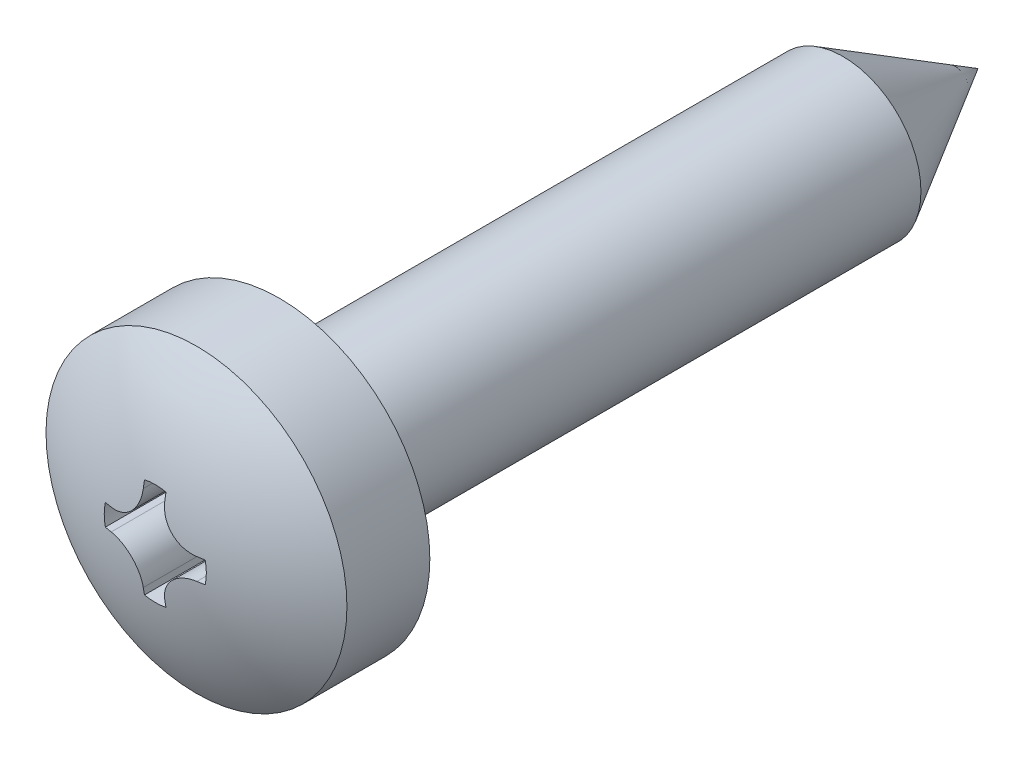
ISO-10303-21;
HEADER;
FILE_DESCRIPTION(('STEP AP214'),'2;1');
FILE_NAME('part.step','',(''),(''),'','','');
FILE_SCHEMA(('AUTOMOTIVE_DESIGN { 1 0 10303 214 1 1 1 1 }'));
ENDSEC;
DATA;
#1=APPLICATION_CONTEXT('core data for automotive mechanical design processes');
#2=APPLICATION_PROTOCOL_DEFINITION('international standard','automotive_design',2000,#1);
#3=PRODUCT_CONTEXT('',#1,'mechanical');
#4=PRODUCT('Part','Part','',(#3));
#5=PRODUCT_RELATED_PRODUCT_CATEGORY('part','',(#4));
#6=PRODUCT_DEFINITION_FORMATION('','',#4);
#7=PRODUCT_DEFINITION_CONTEXT('part definition',#1,'design');
#8=PRODUCT_DEFINITION('design','',#6,#7);
#9=PRODUCT_DEFINITION_SHAPE('','',#8);
#10=(LENGTH_UNIT() NAMED_UNIT(*) SI_UNIT(.MILLI.,.METRE.));
#11=(NAMED_UNIT(*) PLANE_ANGLE_UNIT() SI_UNIT($,.RADIAN.));
#12=(NAMED_UNIT(*) SI_UNIT($,.STERADIAN.) SOLID_ANGLE_UNIT());
#13=UNCERTAINTY_MEASURE_WITH_UNIT(LENGTH_MEASURE(1.E-05),#10,'distance_accuracy_value','');
#14=(GEOMETRIC_REPRESENTATION_CONTEXT(3) GLOBAL_UNCERTAINTY_ASSIGNED_CONTEXT((#13)) GLOBAL_UNIT_ASSIGNED_CONTEXT((#10,
#11,#12)) REPRESENTATION_CONTEXT('',''));
#15=CARTESIAN_POINT('',(0.,0.,0.));
#16=DIRECTION('',(0.,0.,1.));
#17=DIRECTION('',(1.,0.,0.));
#18=AXIS2_PLACEMENT_3D('',#15,#16,#17);
#19=CARTESIAN_POINT('',(0.,0.,10.4));
#20=DIRECTION('',(0.,0.,1.));
#21=DIRECTION('',(0.,1.,0.));
#22=AXIS2_PLACEMENT_3D('',#19,#20,#21);
#23=SPHERICAL_SURFACE('',#22,5.);
#24=CARTESIAN_POINT('',(0.,0.,14.5424630354416));
#25=DIRECTION('',(0.,0.,1.));
#26=DIRECTION('',(1.,0.,0.));
#27=AXIS2_PLACEMENT_3D('',#24,#25,#26);
#28=CIRCLE('',#27,2.8);
#29=CARTESIAN_POINT('',(2.8,0.,14.5424630354416));
#30=VERTEX_POINT('',#29);
#31=EDGE_CURVE('E188',#30,#30,#28,.T.);
#32=ORIENTED_EDGE('',*,*,#31,.T.);
#33=EDGE_LOOP('',(#32));
#34=FACE_BOUND('',#33,.T.);
#35=CARTESIAN_POINT('',(0.,0.,15.3089204515861));
#36=DIRECTION('',(0.,0.,-1.));
#37=DIRECTION('',(-1.,0.,0.));
#38=AXIS2_PLACEMENT_3D('',#35,#36,#37);
#39=CIRCLE('',#38,0.95);
#40=CARTESIAN_POINT('',(0.199999999999999,0.928708781050336,15.3089204515861));
#41=VERTEX_POINT('',#40);
#42=CARTESIAN_POINT('',(-0.199999999999997,0.928708781050336,15.3089204515861));
#43=VERTEX_POINT('',#42);
#44=EDGE_CURVE('E296',#41,#43,#39,.F.);
#45=ORIENTED_EDGE('',*,*,#44,.F.);
#46=CARTESIAN_POINT('',(0.200000000000013,0.,10.4));
#47=DIRECTION('',(-1.,0.,0.));
#48=DIRECTION('',(0.,-1.,0.));
#49=AXIS2_PLACEMENT_3D('',#46,#47,#48);
#50=CIRCLE('',#49,4.99599839871872);
#51=CARTESIAN_POINT('',(0.200000000000001,0.797500009462237,15.3319361040982));
#52=VERTEX_POINT('',#51);
#53=EDGE_CURVE('E174',#52,#41,#50,.T.);
#54=ORIENTED_EDGE('',*,*,#53,.F.);
#55=CARTESIAN_POINT('',(0.200000033472805,0.797700009462236,15.3319037583386));
#56=CARTESIAN_POINT('',(0.199959253117828,0.764708817685606,15.3372450026347));
#57=CARTESIAN_POINT('',(0.202709128813232,0.731640466129004,15.3421389681577));
#58=CARTESIAN_POINT('',(0.213653637195818,0.666282732986849,15.3509117634436));
#59=CARTESIAN_POINT('',(0.221847801353419,0.633993284617508,15.3547906805205));
#60=CARTESIAN_POINT('',(0.243555568778322,0.571088201610532,15.3614171793675));
#61=CARTESIAN_POINT('',(0.257074653927373,0.540474329048727,15.364163589265));
#62=CARTESIAN_POINT('',(0.289068737352572,0.481878485435129,15.3684353734394));
#63=CARTESIAN_POINT('',(0.307541534947129,0.453895353117194,15.3699612887238));
#64=CARTESIAN_POINT('',(0.348646595686665,0.401741777280698,15.371733860277));
#65=CARTESIAN_POINT('',(0.371219136327946,0.377524829205055,15.3719975623989));
#66=CARTESIAN_POINT('',(0.42004221247523,0.33315104363588,15.3712838517845));
#67=CARTESIAN_POINT('',(0.446293163672993,0.312994665649831,15.3703062986749));
#68=CARTESIAN_POINT('',(0.501529122246131,0.277422821121843,15.3671501235125));
#69=CARTESIAN_POINT('',(0.530496065410742,0.261978583187333,15.3649790268822));
#70=CARTESIAN_POINT('',(0.590474078177402,0.236061672214504,15.3595049326867));
#71=CARTESIAN_POINT('',(0.621484749229964,0.225588033102557,15.3562021552872));
#72=CARTESIAN_POINT('',(0.676782180778131,0.211811110107704,15.349515949383));
#73=CARTESIAN_POINT('',(0.700820773823944,0.207371844731834,15.3463573247891));
#74=CARTESIAN_POINT('',(0.749150929493059,0.201461310152338,15.3395132745871));
#75=CARTESIAN_POINT('',(0.773442081704409,0.199985810303452,15.3358286079455));
#76=CARTESIAN_POINT('',(0.797700009462238,0.200000033472804,15.3319037583386));
#77=B_SPLINE_CURVE_WITH_KNOTS('',3,(#55,#56,#57,#58,#59,#60,#61,#62,#63,#64,#65,#66,#67,#68,#69,
#70,#71,#72,#73,#74,#75,#76),.UNSPECIFIED.,.F.,.F.,(4,2,2,2,2,2,2,2,2,2,4),(0.,
0.100151318053274,0.200294018308518,0.30054008372607,0.400741688499828,0.499586204595047,
0.598441899985654,0.696681331546744,0.794901661700852,0.868668187611341,0.942329339997771),.UNSPECIFIED.);
#78=CARTESIAN_POINT('',(0.797500009462238,0.2,15.3319361040982));
#79=VERTEX_POINT('',#78);
#80=EDGE_CURVE('E286',#52,#79,#77,.T.);
#81=ORIENTED_EDGE('',*,*,#80,.T.);
#82=CARTESIAN_POINT('',(0.,0.200000000000013,10.4));
#83=DIRECTION('',(0.,1.,0.));
#84=DIRECTION('',(-1.,0.,0.));
#85=AXIS2_PLACEMENT_3D('',#82,#83,#84);
#86=CIRCLE('',#85,4.99599839871872);
#87=CARTESIAN_POINT('',(0.928708781050337,0.199999999999998,15.3089204515861));
#88=VERTEX_POINT('',#87);
#89=EDGE_CURVE('E294',#79,#88,#86,.T.);
#90=ORIENTED_EDGE('',*,*,#89,.T.);
#91=CARTESIAN_POINT('',(0.,0.,15.3089204515861));
#92=DIRECTION('',(0.,0.,-1.));
#93=DIRECTION('',(-1.,0.,0.));
#94=AXIS2_PLACEMENT_3D('',#91,#92,#93);
#95=CIRCLE('',#94,0.950000000000001);
#96=CARTESIAN_POINT('',(0.928708781050337,-0.199999999999996,15.3089204515861));
#97=VERTEX_POINT('',#96);
#98=EDGE_CURVE('E369',#88,#97,#95,.T.);
#99=ORIENTED_EDGE('',*,*,#98,.T.);
#100=CARTESIAN_POINT('',(0.,-0.200000000000022,10.4));
#101=DIRECTION('',(0.,1.,0.));
#102=DIRECTION('',(-1.,0.,0.));
#103=AXIS2_PLACEMENT_3D('',#100,#101,#102);
#104=CIRCLE('',#103,4.99599839871872);
#105=CARTESIAN_POINT('',(0.797500009462238,-0.2,15.3319361040982));
#106=VERTEX_POINT('',#105);
#107=EDGE_CURVE('E258',#106,#97,#104,.T.);
#108=ORIENTED_EDGE('',*,*,#107,.F.);
#109=CARTESIAN_POINT('',(0.200000033472805,-0.797700009462236,15.3319037583386));
#110=CARTESIAN_POINT('',(0.199959253117828,-0.764708817685605,15.3372450026347));
#111=CARTESIAN_POINT('',(0.202709128813232,-0.731640466129003,15.3421389681577));
#112=CARTESIAN_POINT('',(0.213653637195818,-0.666282732986848,15.3509117634436));
#113=CARTESIAN_POINT('',(0.221847801353419,-0.633993284617508,15.3547906805205));
#114=CARTESIAN_POINT('',(0.243555568778322,-0.571088201610531,15.3614171793675));
#115=CARTESIAN_POINT('',(0.257074653927373,-0.540474329048727,15.364163589265));
#116=CARTESIAN_POINT('',(0.289068737352572,-0.481878485435129,15.3684353734394));
#117=CARTESIAN_POINT('',(0.30754153494713,-0.453895353117194,15.3699612887238));
#118=CARTESIAN_POINT('',(0.348646595686666,-0.401741777280697,15.371733860277));
#119=CARTESIAN_POINT('',(0.371219136327946,-0.377524829205055,15.3719975623989));
#120=CARTESIAN_POINT('',(0.42004221247523,-0.33315104363588,15.3712838517845));
#121=CARTESIAN_POINT('',(0.446293163672993,-0.31299466564983,15.370306298675));
#122=CARTESIAN_POINT('',(0.501529122246131,-0.277422821121843,15.3671501235125));
#123=CARTESIAN_POINT('',(0.530496065410743,-0.261978583187333,15.3649790268822));
#124=CARTESIAN_POINT('',(0.590474078177402,-0.236061672214504,15.3595049326867));
#125=CARTESIAN_POINT('',(0.621484749229964,-0.225588033102557,15.3562021552872));
#126=CARTESIAN_POINT('',(0.676782180778131,-0.211811110107704,15.349515949383));
#127=CARTESIAN_POINT('',(0.700820773823944,-0.207371844731834,15.3463573247891));
#128=CARTESIAN_POINT('',(0.749150929493059,-0.201461310152338,15.3395132745871));
#129=CARTESIAN_POINT('',(0.773442081704409,-0.199985810303452,15.3358286079455));
#130=CARTESIAN_POINT('',(0.797700009462237,-0.200000033472804,15.3319037583386));
#131=B_SPLINE_CURVE_WITH_KNOTS('',3,(#109,#110,#111,#112,#113,#114,#115,#116,#117,#118,#119,
#120,#121,#122,#123,#124,#125,#126,#127,#128,#129,#130),.UNSPECIFIED.,.F.,.F.,(4,2,2,2,2,2,2,2,
2,2,4),(0.,0.100151318053274,0.200294018308518,0.300540083726071,0.400741688499828,
0.499586204595048,0.598441899985654,0.696681331546745,0.794901661700852,0.868668187611341,
0.94232933999777),.UNSPECIFIED.);
#132=CARTESIAN_POINT('',(0.200000000000001,-0.797500009462237,15.3319361040982));
#133=VERTEX_POINT('',#132);
#134=EDGE_CURVE('E251',#133,#106,#131,.T.);
#135=ORIENTED_EDGE('',*,*,#134,.F.);
#136=CARTESIAN_POINT('',(0.20000000000001,0.,10.4));
#137=DIRECTION('',(1.,0.,0.));
#138=DIRECTION('',(0.,1.,0.));
#139=AXIS2_PLACEMENT_3D('',#136,#137,#138);
#140=CIRCLE('',#139,4.99599839871872);
#141=CARTESIAN_POINT('',(0.199999999999999,-0.928708781050336,15.3089204515861));
#142=VERTEX_POINT('',#141);
#143=EDGE_CURVE('E248',#133,#142,#140,.T.);
#144=ORIENTED_EDGE('',*,*,#143,.T.);
#145=CARTESIAN_POINT('',(0.,0.,15.3089204515861));
#146=DIRECTION('',(0.,0.,-1.));
#147=DIRECTION('',(-1.,0.,0.));
#148=AXIS2_PLACEMENT_3D('',#145,#146,#147);
#149=CIRCLE('',#148,0.95);
#150=CARTESIAN_POINT('',(-0.199999999999997,-0.928708781050336,15.3089204515861));
#151=VERTEX_POINT('',#150);
#152=EDGE_CURVE('E245',#142,#151,#149,.T.);
#153=ORIENTED_EDGE('',*,*,#152,.T.);
#154=CARTESIAN_POINT('',(-0.200000000000015,0.,10.4));
#155=DIRECTION('',(1.,0.,0.));
#156=DIRECTION('',(0.,1.,0.));
#157=AXIS2_PLACEMENT_3D('',#154,#155,#156);
#158=CIRCLE('',#157,4.99599839871872);
#159=CARTESIAN_POINT('',(-0.2,-0.797500009462236,15.3319361040982));
#160=VERTEX_POINT('',#159);
#161=EDGE_CURVE('E242',#160,#151,#158,.T.);
#162=ORIENTED_EDGE('',*,*,#161,.F.);
#163=CARTESIAN_POINT('',(-0.200000033472803,-0.797700009462235,15.3319037583386));
#164=CARTESIAN_POINT('',(-0.199959253117827,-0.764708817685605,15.3372450026347));
#165=CARTESIAN_POINT('',(-0.202709128813231,-0.731640466129003,15.3421389681577));
#166=CARTESIAN_POINT('',(-0.213653637195817,-0.666282732986847,15.3509117634436));
#167=CARTESIAN_POINT('',(-0.221847801353417,-0.633993284617507,15.3547906805205));
#168=CARTESIAN_POINT('',(-0.243555568778321,-0.57108820161053,15.3614171793675));
#169=CARTESIAN_POINT('',(-0.257074653927372,-0.540474329048725,15.364163589265));
#170=CARTESIAN_POINT('',(-0.289068737352571,-0.481878485435128,15.3684353734394));
#171=CARTESIAN_POINT('',(-0.307541534947129,-0.453895353117193,15.3699612887238));
#172=CARTESIAN_POINT('',(-0.348646595686664,-0.401741777280696,15.371733860277));
#173=CARTESIAN_POINT('',(-0.371219136327945,-0.377524829205054,15.3719975623989));
#174=CARTESIAN_POINT('',(-0.420042212475229,-0.333151043635879,15.3712838517845));
#175=CARTESIAN_POINT('',(-0.446293163672992,-0.312994665649829,15.370306298675));
#176=CARTESIAN_POINT('',(-0.50152912224613,-0.277422821121842,15.3671501235125));
#177=CARTESIAN_POINT('',(-0.530496065410741,-0.261978583187332,15.3649790268822));
#178=CARTESIAN_POINT('',(-0.590474078177401,-0.236061672214503,15.3595049326867));
#179=CARTESIAN_POINT('',(-0.621484749229963,-0.225588033102557,15.3562021552872));
#180=CARTESIAN_POINT('',(-0.676782180778129,-0.211811110107703,15.349515949383));
#181=CARTESIAN_POINT('',(-0.700820773823943,-0.207371844731833,15.3463573247891));
#182=CARTESIAN_POINT('',(-0.749150929493057,-0.201461310152337,15.3395132745871));
#183=CARTESIAN_POINT('',(-0.773442081704407,-0.199985810303451,15.3358286079455));
#184=CARTESIAN_POINT('',(-0.797700009462235,-0.200000033472803,15.3319037583386));
#185=B_SPLINE_CURVE_WITH_KNOTS('',3,(#163,#164,#165,#166,#167,#168,#169,#170,#171,#172,#173,
#174,#175,#176,#177,#178,#179,#180,#181,#182,#183,#184),.UNSPECIFIED.,.F.,.F.,(4,2,2,2,2,2,2,2,
2,2,4),(0.,0.100151318053273,0.200294018308518,0.300540083726071,0.400741688499828,
0.499586204595048,0.598441899985654,0.696681331546744,0.794901661700852,0.868668187611341,
0.942329339997769),.UNSPECIFIED.);
#186=CARTESIAN_POINT('',(-0.797500009462236,-0.199999999999999,15.3319361040982));
#187=VERTEX_POINT('',#186);
#188=EDGE_CURVE('E234',#160,#187,#185,.T.);
#189=ORIENTED_EDGE('',*,*,#188,.T.);
#190=CARTESIAN_POINT('',(0.,-0.200000000000015,10.4));
#191=DIRECTION('',(0.,-1.,0.));
#192=DIRECTION('',(1.,0.,0.));
#193=AXIS2_PLACEMENT_3D('',#190,#191,#192);
#194=CIRCLE('',#193,4.99599839871872);
#195=CARTESIAN_POINT('',(-0.928708781050336,-0.199999999999997,15.3089204515861));
#196=VERTEX_POINT('',#195);
#197=EDGE_CURVE('E243',#187,#196,#194,.T.);
#198=ORIENTED_EDGE('',*,*,#197,.T.);
#199=CARTESIAN_POINT('',(0.,0.,15.3089204515861));
#200=DIRECTION('',(0.,0.,-1.));
#201=DIRECTION('',(-1.,0.,0.));
#202=AXIS2_PLACEMENT_3D('',#199,#200,#201);
#203=CIRCLE('',#202,0.95);
#204=CARTESIAN_POINT('',(-0.928708781050336,0.199999999999997,15.3089204515861));
#205=VERTEX_POINT('',#204);
#206=EDGE_CURVE('E408',#205,#196,#203,.F.);
#207=ORIENTED_EDGE('',*,*,#206,.F.);
#208=CARTESIAN_POINT('',(0.,0.200000000000015,10.4));
#209=DIRECTION('',(0.,-1.,0.));
#210=DIRECTION('',(1.,0.,0.));
#211=AXIS2_PLACEMENT_3D('',#208,#209,#210);
#212=CIRCLE('',#211,4.99599839871872);
#213=CARTESIAN_POINT('',(-0.797500009462236,0.199999999999999,15.3319361040982));
#214=VERTEX_POINT('',#213);
#215=EDGE_CURVE('E202',#214,#205,#212,.T.);
#216=ORIENTED_EDGE('',*,*,#215,.F.);
#217=CARTESIAN_POINT('',(-0.200000033472804,0.797700009462235,15.3319037583386));
#218=CARTESIAN_POINT('',(-0.199959253117827,0.764708817685605,15.3372450026347));
#219=CARTESIAN_POINT('',(-0.202709128813231,0.731640466129002,15.3421389681577));
#220=CARTESIAN_POINT('',(-0.213653637195817,0.666282732986847,15.3509117634436));
#221=CARTESIAN_POINT('',(-0.221847801353417,0.633993284617507,15.3547906805205));
#222=CARTESIAN_POINT('',(-0.24355556877832,0.571088201610531,15.3614171793675));
#223=CARTESIAN_POINT('',(-0.257074653927372,0.540474329048726,15.364163589265));
#224=CARTESIAN_POINT('',(-0.28906873735257,0.481878485435128,15.3684353734394));
#225=CARTESIAN_POINT('',(-0.307541534947128,0.453895353117193,15.3699612887238));
#226=CARTESIAN_POINT('',(-0.348646595686664,0.401741777280697,15.371733860277));
#227=CARTESIAN_POINT('',(-0.371219136327945,0.377524829205054,15.3719975623989));
#228=CARTESIAN_POINT('',(-0.420042212475228,0.333151043635879,15.3712838517845));
#229=CARTESIAN_POINT('',(-0.446293163672991,0.31299466564983,15.370306298675));
#230=CARTESIAN_POINT('',(-0.501529122246129,0.277422821121843,15.3671501235125));
#231=CARTESIAN_POINT('',(-0.53049606541074,0.261978583187332,15.3649790268822));
#232=CARTESIAN_POINT('',(-0.5904740781774,0.236061672214503,15.3595049326867));
#233=CARTESIAN_POINT('',(-0.621484749229962,0.225588033102557,15.3562021552872));
#234=CARTESIAN_POINT('',(-0.676782180778129,0.211811110107703,15.349515949383));
#235=CARTESIAN_POINT('',(-0.700820773823943,0.207371844731833,15.3463573247891));
#236=CARTESIAN_POINT('',(-0.749150929493057,0.201461310152337,15.3395132745871));
#237=CARTESIAN_POINT('',(-0.773442081704407,0.199985810303451,15.3358286079455));
#238=CARTESIAN_POINT('',(-0.797700009462235,0.200000033472803,15.3319037583386));
#239=B_SPLINE_CURVE_WITH_KNOTS('',3,(#217,#218,#219,#220,#221,#222,#223,#224,#225,#226,#227,
#228,#229,#230,#231,#232,#233,#234,#235,#236,#237,#238),.UNSPECIFIED.,.F.,.F.,(4,2,2,2,2,2,2,2,
2,2,4),(0.,0.100151318053274,0.200294018308518,0.30054008372607,0.400741688499828,
0.499586204595047,0.598441899985653,0.696681331546744,0.794901661700851,0.868668187611341,
0.94232933999777),.UNSPECIFIED.);
#240=CARTESIAN_POINT('',(-0.2,0.797500009462236,15.3319361040982));
#241=VERTEX_POINT('',#240);
#242=EDGE_CURVE('E194',#241,#214,#239,.T.);
#243=ORIENTED_EDGE('',*,*,#242,.F.);
#244=CARTESIAN_POINT('',(-0.200000000000015,0.,10.4));
#245=DIRECTION('',(-1.,0.,0.));
#246=DIRECTION('',(0.,-1.,0.));
#247=AXIS2_PLACEMENT_3D('',#244,#245,#246);
#248=CIRCLE('',#247,4.99599839871872);
#249=EDGE_CURVE('E191',#241,#43,#248,.T.);
#250=ORIENTED_EDGE('',*,*,#249,.T.);
#251=EDGE_LOOP('',(#45,#54,#81,#90,#99,#108,#135,#144,#153,#162,#189,#198,#207,#216,#243,#250));
#252=FACE_BOUND('',#251,.T.);
#253=ADVANCED_FACE('F39',(#34,#252),#23,.T.);
#254=CARTESIAN_POINT('',(0.,0.,0.));
#255=DIRECTION('',(0.,0.,1.));
#256=DIRECTION('',(1.,0.,0.));
#257=AXIS2_PLACEMENT_3D('',#254,#255,#256);
#258=CONICAL_SURFACE('',#257,0.,0.523598775598293);
#259=CARTESIAN_POINT('',(0.,0.,2.5114736709749));
#260=DIRECTION('',(0.,0.,1.));
#261=DIRECTION('',(1.,0.,0.));
#262=AXIS2_PLACEMENT_3D('',#259,#260,#261);
#263=CIRCLE('',#262,1.45);
#264=CARTESIAN_POINT('',(1.45,0.,2.5114736709749));
#265=VERTEX_POINT('',#264);
#266=EDGE_CURVE('E175',#265,#265,#263,.T.);
#267=ORIENTED_EDGE('',*,*,#266,.F.);
#268=EDGE_LOOP('',(#267));
#269=FACE_BOUND('',#268,.T.);
#270=CARTESIAN_POINT('',(0.,0.,0.));
#271=VERTEX_POINT('',#270);
#272=VERTEX_LOOP('',#271);
#273=FACE_BOUND('',#272,.T.);
#274=ADVANCED_FACE('F310',(#269,#273),#258,.T.);
#275=CARTESIAN_POINT('',(0.,0.,11.71));
#276=DIRECTION('',(0.,0.,1.));
#277=DIRECTION('',(1.,0.,0.));
#278=AXIS2_PLACEMENT_3D('',#275,#276,#277);
#279=CYLINDRICAL_SURFACE('',#278,2.8);
#280=ORIENTED_EDGE('',*,*,#31,.F.);
#281=EDGE_LOOP('',(#280));
#282=FACE_BOUND('',#281,.T.);
#283=CARTESIAN_POINT('',(0.,0.,13.));
#284=DIRECTION('',(0.,0.,1.));
#285=DIRECTION('',(1.,0.,0.));
#286=AXIS2_PLACEMENT_3D('',#283,#284,#285);
#287=CIRCLE('',#286,2.8);
#288=CARTESIAN_POINT('',(2.8,0.,13.));
#289=VERTEX_POINT('',#288);
#290=EDGE_CURVE('E179',#289,#289,#287,.T.);
#291=ORIENTED_EDGE('',*,*,#290,.T.);
#292=EDGE_LOOP('',(#291));
#293=FACE_BOUND('',#292,.T.);
#294=ADVANCED_FACE('F315',(#282,#293),#279,.T.);
#295=CARTESIAN_POINT('',(0.,2.8,13.));
#296=DIRECTION('',(0.,0.,1.));
#297=DIRECTION('',(1.,0.,0.));
#298=AXIS2_PLACEMENT_3D('',#295,#296,#297);
#299=PLANE('',#298);
#300=CARTESIAN_POINT('',(0.,0.,13.));
#301=DIRECTION('',(0.,0.,1.));
#302=DIRECTION('',(1.,0.,0.));
#303=AXIS2_PLACEMENT_3D('',#300,#301,#302);
#304=CIRCLE('',#303,1.55);
#305=CARTESIAN_POINT('',(1.55,0.,13.));
#306=VERTEX_POINT('',#305);
#307=EDGE_CURVE('E48',#306,#306,#304,.T.);
#308=ORIENTED_EDGE('',*,*,#307,.T.);
#309=EDGE_LOOP('',(#308));
#310=FACE_BOUND('',#309,.T.);
#311=ORIENTED_EDGE('',*,*,#290,.F.);
#312=EDGE_LOOP('',(#311));
#313=FACE_BOUND('',#312,.T.);
#314=ADVANCED_FACE('F300',(#310,#313),#299,.F.);
#315=CARTESIAN_POINT('',(0.,0.,11.71));
#316=DIRECTION('',(0.,0.,1.));
#317=DIRECTION('',(1.,0.,0.));
#318=AXIS2_PLACEMENT_3D('',#315,#316,#317);
#319=CYLINDRICAL_SURFACE('',#318,1.45);
#320=CARTESIAN_POINT('',(0.,0.,12.9));
#321=DIRECTION('',(0.,0.,1.));
#322=DIRECTION('',(1.,0.,0.));
#323=AXIS2_PLACEMENT_3D('',#320,#321,#322);
#324=CIRCLE('',#323,1.45);
#325=CARTESIAN_POINT('',(1.45,0.,12.9));
#326=VERTEX_POINT('',#325);
#327=EDGE_CURVE('E11',#326,#326,#324,.F.);
#328=ORIENTED_EDGE('',*,*,#327,.T.);
#329=EDGE_LOOP('',(#328));
#330=FACE_BOUND('',#329,.T.);
#331=ORIENTED_EDGE('',*,*,#266,.T.);
#332=EDGE_LOOP('',(#331));
#333=FACE_BOUND('',#332,.T.);
#334=ADVANCED_FACE('F462',(#330,#333),#319,.T.);
#335=CARTESIAN_POINT('',(0.,0.,14.2));
#336=DIRECTION('',(0.,0.,1.));
#337=DIRECTION('',(1.,0.,0.));
#338=AXIS2_PLACEMENT_3D('',#335,#336,#337);
#339=CYLINDRICAL_SURFACE('',#338,0.95);
#340=ORIENTED_EDGE('',*,*,#44,.T.);
#341=DIRECTION('',(0.,0.,1.));
#342=VECTOR('',#341,1.);
#343=CARTESIAN_POINT('',(-0.199999999999997,0.928708781050336,14.2));
#344=LINE('',#343,#342);
#345=CARTESIAN_POINT('',(-0.199999999999997,0.928708781050336,14.2));
#346=VERTEX_POINT('',#345);
#347=EDGE_CURVE('E55',#346,#43,#344,.T.);
#348=ORIENTED_EDGE('',*,*,#347,.F.);
#349=CARTESIAN_POINT('',(0.,0.,14.2));
#350=DIRECTION('',(0.,0.,-1.));
#351=DIRECTION('',(-1.,0.,0.));
#352=AXIS2_PLACEMENT_3D('',#349,#350,#351);
#353=CIRCLE('',#352,0.95);
#354=CARTESIAN_POINT('',(0.199999999999999,0.928708781050336,14.2));
#355=VERTEX_POINT('',#354);
#356=EDGE_CURVE('E157',#346,#355,#353,.T.);
#357=ORIENTED_EDGE('',*,*,#356,.T.);
#358=DIRECTION('',(0.,0.,1.));
#359=VECTOR('',#358,1.);
#360=CARTESIAN_POINT('',(0.199999999999999,0.928708781050336,14.2));
#361=LINE('',#360,#359);
#362=EDGE_CURVE('E169',#355,#41,#361,.T.);
#363=ORIENTED_EDGE('',*,*,#362,.T.);
#364=EDGE_LOOP('',(#340,#348,#357,#363));
#365=FACE_BOUND('',#364,.T.);
#366=ADVANCED_FACE('F168',(#365),#339,.F.);
#367=CARTESIAN_POINT('',(0.199999999999999,0.928708781050336,14.2));
#368=DIRECTION('',(-1.,0.,0.));
#369=DIRECTION('',(0.,-1.,0.));
#370=AXIS2_PLACEMENT_3D('',#367,#368,#369);
#371=PLANE('',#370);
#372=ORIENTED_EDGE('',*,*,#53,.T.);
#373=ORIENTED_EDGE('',*,*,#362,.F.);
#374=DIRECTION('',(0.,-1.,0.));
#375=VECTOR('',#374,1.);
#376=CARTESIAN_POINT('',(0.199999999999999,0.928708781050336,14.2));
#377=LINE('',#376,#375);
#378=CARTESIAN_POINT('',(0.200000000000001,0.797500009462237,14.2));
#379=VERTEX_POINT('',#378);
#380=EDGE_CURVE('E153',#355,#379,#377,.T.);
#381=ORIENTED_EDGE('',*,*,#380,.T.);
#382=DIRECTION('',(0.,0.,1.));
#383=VECTOR('',#382,1.);
#384=CARTESIAN_POINT('',(0.200000000000001,0.797500009462237,14.2));
#385=LINE('',#384,#383);
#386=EDGE_CURVE('E176',#379,#52,#385,.T.);
#387=ORIENTED_EDGE('',*,*,#386,.T.);
#388=EDGE_LOOP('',(#372,#373,#381,#387));
#389=FACE_BOUND('',#388,.T.);
#390=ADVANCED_FACE('F172',(#389),#371,.T.);
#391=CARTESIAN_POINT('',(0.797500009462238,0.797500009462237,14.2));
#392=DIRECTION('',(0.,0.,1.));
#393=DIRECTION('',(1.,0.,0.));
#394=AXIS2_PLACEMENT_3D('',#391,#392,#393);
#395=CYLINDRICAL_SURFACE('',#394,0.597500009462237);
#396=ORIENTED_EDGE('',*,*,#386,.F.);
#397=CARTESIAN_POINT('',(0.797500009462238,0.797500009462237,14.2));
#398=DIRECTION('',(0.,0.,-1.));
#399=DIRECTION('',(-1.,0.,0.));
#400=AXIS2_PLACEMENT_3D('',#397,#398,#399);
#401=CIRCLE('',#400,0.597500009462237);
#402=CARTESIAN_POINT('',(0.797500009462238,0.2,14.2));
#403=VERTEX_POINT('',#402);
#404=EDGE_CURVE('E160',#403,#379,#401,.T.);
#405=ORIENTED_EDGE('',*,*,#404,.F.);
#406=DIRECTION('',(0.,0.,1.));
#407=VECTOR('',#406,1.);
#408=CARTESIAN_POINT('',(0.797500009462238,0.2,14.2));
#409=LINE('',#408,#407);
#410=EDGE_CURVE('E181',#403,#79,#409,.T.);
#411=ORIENTED_EDGE('',*,*,#410,.T.);
#412=ORIENTED_EDGE('',*,*,#80,.F.);
#413=EDGE_LOOP('',(#396,#405,#411,#412));
#414=FACE_BOUND('',#413,.T.);
#415=ADVANCED_FACE('F278',(#414),#395,.T.);
#416=CARTESIAN_POINT('',(0.928708781050337,0.199999999999998,14.2));
#417=DIRECTION('',(0.,1.,0.));
#418=DIRECTION('',(-1.,0.,0.));
#419=AXIS2_PLACEMENT_3D('',#416,#417,#418);
#420=PLANE('',#419);
#421=ORIENTED_EDGE('',*,*,#410,.F.);
#422=DIRECTION('',(-1.,0.,0.));
#423=VECTOR('',#422,1.);
#424=CARTESIAN_POINT('',(0.928708781050337,0.199999999999998,14.2));
#425=LINE('',#424,#423);
#426=CARTESIAN_POINT('',(0.928708781050337,0.199999999999998,14.2));
#427=VERTEX_POINT('',#426);
#428=EDGE_CURVE('E377',#427,#403,#425,.T.);
#429=ORIENTED_EDGE('',*,*,#428,.F.);
#430=DIRECTION('',(0.,0.,1.));
#431=VECTOR('',#430,1.);
#432=CARTESIAN_POINT('',(0.928708781050337,0.199999999999998,14.2));
#433=LINE('',#432,#431);
#434=EDGE_CURVE('E362',#427,#88,#433,.T.);
#435=ORIENTED_EDGE('',*,*,#434,.T.);
#436=ORIENTED_EDGE('',*,*,#89,.F.);
#437=EDGE_LOOP('',(#421,#429,#435,#436));
#438=FACE_BOUND('',#437,.T.);
#439=ADVANCED_FACE('F274',(#438),#420,.F.);
#440=CARTESIAN_POINT('',(0.,0.,14.2));
#441=DIRECTION('',(0.,0.,1.));
#442=DIRECTION('',(1.,0.,0.));
#443=AXIS2_PLACEMENT_3D('',#440,#441,#442);
#444=CYLINDRICAL_SURFACE('',#443,0.950000000000001);
#445=ORIENTED_EDGE('',*,*,#434,.F.);
#446=CARTESIAN_POINT('',(0.,0.,14.2));
#447=DIRECTION('',(0.,0.,1.));
#448=DIRECTION('',(1.,0.,0.));
#449=AXIS2_PLACEMENT_3D('',#446,#447,#448);
#450=CIRCLE('',#449,0.950000000000001);
#451=CARTESIAN_POINT('',(0.928708781050337,-0.199999999999997,14.2));
#452=VERTEX_POINT('',#451);
#453=EDGE_CURVE('E375',#452,#427,#450,.T.);
#454=ORIENTED_EDGE('',*,*,#453,.F.);
#455=DIRECTION('',(0.,0.,1.));
#456=VECTOR('',#455,1.);
#457=CARTESIAN_POINT('',(0.928708781050337,-0.199999999999997,14.2));
#458=LINE('',#457,#456);
#459=EDGE_CURVE('E359',#452,#97,#458,.T.);
#460=ORIENTED_EDGE('',*,*,#459,.T.);
#461=ORIENTED_EDGE('',*,*,#98,.F.);
#462=EDGE_LOOP('',(#445,#454,#460,#461));
#463=FACE_BOUND('',#462,.T.);
#464=ADVANCED_FACE('F270',(#463),#444,.F.);
#465=CARTESIAN_POINT('',(0.928708781050338,-0.199999999999996,14.2));
#466=DIRECTION('',(0.,1.,0.));
#467=DIRECTION('',(-1.,0.,0.));
#468=AXIS2_PLACEMENT_3D('',#465,#466,#467);
#469=PLANE('',#468);
#470=ORIENTED_EDGE('',*,*,#107,.T.);
#471=ORIENTED_EDGE('',*,*,#459,.F.);
#472=DIRECTION('',(-1.,0.,0.));
#473=VECTOR('',#472,1.);
#474=CARTESIAN_POINT('',(0.928708781050338,-0.199999999999996,14.2));
#475=LINE('',#474,#473);
#476=CARTESIAN_POINT('',(0.797500009462238,-0.2,14.2));
#477=VERTEX_POINT('',#476);
#478=EDGE_CURVE('E376',#452,#477,#475,.T.);
#479=ORIENTED_EDGE('',*,*,#478,.T.);
#480=DIRECTION('',(0.,0.,1.));
#481=VECTOR('',#480,1.);
#482=CARTESIAN_POINT('',(0.797500009462238,-0.2,14.2));
#483=LINE('',#482,#481);
#484=EDGE_CURVE('E356',#477,#106,#483,.T.);
#485=ORIENTED_EDGE('',*,*,#484,.T.);
#486=EDGE_LOOP('',(#470,#471,#479,#485));
#487=FACE_BOUND('',#486,.T.);
#488=ADVANCED_FACE('F266',(#487),#469,.T.);
#489=CARTESIAN_POINT('',(0.797500009462238,-0.797500009462237,14.2));
#490=DIRECTION('',(0.,0.,1.));
#491=DIRECTION('',(1.,0.,0.));
#492=AXIS2_PLACEMENT_3D('',#489,#490,#491);
#493=CYLINDRICAL_SURFACE('',#492,0.597500009462237);
#494=ORIENTED_EDGE('',*,*,#134,.T.);
#495=ORIENTED_EDGE('',*,*,#484,.F.);
#496=CARTESIAN_POINT('',(0.797500009462238,-0.797500009462237,14.2));
#497=DIRECTION('',(0.,0.,1.));
#498=DIRECTION('',(1.,0.,0.));
#499=AXIS2_PLACEMENT_3D('',#496,#497,#498);
#500=CIRCLE('',#499,0.597500009462237);
#501=CARTESIAN_POINT('',(0.200000000000001,-0.797500009462237,14.2));
#502=VERTEX_POINT('',#501);
#503=EDGE_CURVE('E379',#477,#502,#500,.T.);
#504=ORIENTED_EDGE('',*,*,#503,.T.);
#505=DIRECTION('',(0.,0.,1.));
#506=VECTOR('',#505,1.);
#507=CARTESIAN_POINT('',(0.200000000000001,-0.797500009462237,14.2));
#508=LINE('',#507,#506);
#509=EDGE_CURVE('E353',#502,#133,#508,.T.);
#510=ORIENTED_EDGE('',*,*,#509,.T.);
#511=EDGE_LOOP('',(#494,#495,#504,#510));
#512=FACE_BOUND('',#511,.T.);
#513=ADVANCED_FACE('F260',(#512),#493,.T.);
#514=CARTESIAN_POINT('',(0.199999999999999,-0.928708781050336,14.2));
#515=DIRECTION('',(1.,0.,0.));
#516=DIRECTION('',(0.,1.,0.));
#517=AXIS2_PLACEMENT_3D('',#514,#515,#516);
#518=PLANE('',#517);
#519=ORIENTED_EDGE('',*,*,#509,.F.);
#520=DIRECTION('',(0.,1.,0.));
#521=VECTOR('',#520,1.);
#522=CARTESIAN_POINT('',(0.199999999999999,-0.928708781050336,14.2));
#523=LINE('',#522,#521);
#524=CARTESIAN_POINT('',(0.199999999999999,-0.928708781050336,14.2));
#525=VERTEX_POINT('',#524);
#526=EDGE_CURVE('E385',#525,#502,#523,.T.);
#527=ORIENTED_EDGE('',*,*,#526,.F.);
#528=DIRECTION('',(0.,0.,1.));
#529=VECTOR('',#528,1.);
#530=CARTESIAN_POINT('',(0.199999999999999,-0.928708781050336,14.2));
#531=LINE('',#530,#529);
#532=EDGE_CURVE('E350',#525,#142,#531,.T.);
#533=ORIENTED_EDGE('',*,*,#532,.T.);
#534=ORIENTED_EDGE('',*,*,#143,.F.);
#535=EDGE_LOOP('',(#519,#527,#533,#534));
#536=FACE_BOUND('',#535,.T.);
#537=ADVANCED_FACE('F265',(#536),#518,.F.);
#538=CARTESIAN_POINT('',(0.,0.,14.2));
#539=DIRECTION('',(0.,0.,1.));
#540=DIRECTION('',(1.,0.,0.));
#541=AXIS2_PLACEMENT_3D('',#538,#539,#540);
#542=CYLINDRICAL_SURFACE('',#541,0.95);
#543=ORIENTED_EDGE('',*,*,#532,.F.);
#544=CARTESIAN_POINT('',(0.,0.,14.2));
#545=DIRECTION('',(0.,0.,1.));
#546=DIRECTION('',(1.,0.,0.));
#547=AXIS2_PLACEMENT_3D('',#544,#545,#546);
#548=CIRCLE('',#547,0.95);
#549=CARTESIAN_POINT('',(-0.199999999999997,-0.928708781050336,14.2));
#550=VERTEX_POINT('',#549);
#551=EDGE_CURVE('E388',#550,#525,#548,.T.);
#552=ORIENTED_EDGE('',*,*,#551,.F.);
#553=DIRECTION('',(0.,0.,1.));
#554=VECTOR('',#553,1.);
#555=CARTESIAN_POINT('',(-0.199999999999997,-0.928708781050336,14.2));
#556=LINE('',#555,#554);
#557=EDGE_CURVE('E347',#550,#151,#556,.T.);
#558=ORIENTED_EDGE('',*,*,#557,.T.);
#559=ORIENTED_EDGE('',*,*,#152,.F.);
#560=EDGE_LOOP('',(#543,#552,#558,#559));
#561=FACE_BOUND('',#560,.T.);
#562=ADVANCED_FACE('F417',(#561),#542,.F.);
#563=CARTESIAN_POINT('',(-0.199999999999997,-0.928708781050336,14.2));
#564=DIRECTION('',(1.,0.,0.));
#565=DIRECTION('',(0.,1.,0.));
#566=AXIS2_PLACEMENT_3D('',#563,#564,#565);
#567=PLANE('',#566);
#568=ORIENTED_EDGE('',*,*,#161,.T.);
#569=ORIENTED_EDGE('',*,*,#557,.F.);
#570=DIRECTION('',(0.,1.,0.));
#571=VECTOR('',#570,1.);
#572=CARTESIAN_POINT('',(-0.199999999999997,-0.928708781050336,14.2));
#573=LINE('',#572,#571);
#574=CARTESIAN_POINT('',(-0.2,-0.797500009462236,14.2));
#575=VERTEX_POINT('',#574);
#576=EDGE_CURVE('E391',#550,#575,#573,.T.);
#577=ORIENTED_EDGE('',*,*,#576,.T.);
#578=DIRECTION('',(0.,0.,1.));
#579=VECTOR('',#578,1.);
#580=CARTESIAN_POINT('',(-0.2,-0.797500009462236,14.2));
#581=LINE('',#580,#579);
#582=EDGE_CURVE('E344',#575,#160,#581,.T.);
#583=ORIENTED_EDGE('',*,*,#582,.T.);
#584=EDGE_LOOP('',(#568,#569,#577,#583));
#585=FACE_BOUND('',#584,.T.);
#586=ADVANCED_FACE('F230',(#585),#567,.T.);
#587=CARTESIAN_POINT('',(-0.797500009462237,-0.797500009462236,14.2));
#588=DIRECTION('',(0.,0.,1.));
#589=DIRECTION('',(1.,0.,0.));
#590=AXIS2_PLACEMENT_3D('',#587,#588,#589);
#591=CYLINDRICAL_SURFACE('',#590,0.597500009462237);
#592=ORIENTED_EDGE('',*,*,#582,.F.);
#593=CARTESIAN_POINT('',(-0.797500009462237,-0.797500009462236,14.2));
#594=DIRECTION('',(0.,0.,-1.));
#595=DIRECTION('',(-1.,0.,0.));
#596=AXIS2_PLACEMENT_3D('',#593,#594,#595);
#597=CIRCLE('',#596,0.597500009462237);
#598=CARTESIAN_POINT('',(-0.797500009462236,-0.199999999999999,14.2));
#599=VERTEX_POINT('',#598);
#600=EDGE_CURVE('E393',#599,#575,#597,.T.);
#601=ORIENTED_EDGE('',*,*,#600,.F.);
#602=DIRECTION('',(0.,0.,1.));
#603=VECTOR('',#602,1.);
#604=CARTESIAN_POINT('',(-0.797500009462236,-0.199999999999999,14.2));
#605=LINE('',#604,#603);
#606=EDGE_CURVE('E341',#599,#187,#605,.T.);
#607=ORIENTED_EDGE('',*,*,#606,.T.);
#608=ORIENTED_EDGE('',*,*,#188,.F.);
#609=EDGE_LOOP('',(#592,#601,#607,#608));
#610=FACE_BOUND('',#609,.T.);
#611=ADVANCED_FACE('F225',(#610),#591,.T.);
#612=CARTESIAN_POINT('',(-0.928708781050336,-0.199999999999997,14.2));
#613=DIRECTION('',(0.,-1.,0.));
#614=DIRECTION('',(1.,0.,0.));
#615=AXIS2_PLACEMENT_3D('',#612,#613,#614);
#616=PLANE('',#615);
#617=ORIENTED_EDGE('',*,*,#606,.F.);
#618=DIRECTION('',(1.,0.,0.));
#619=VECTOR('',#618,1.);
#620=CARTESIAN_POINT('',(-0.928708781050336,-0.199999999999997,14.2));
#621=LINE('',#620,#619);
#622=CARTESIAN_POINT('',(-0.928708781050336,-0.199999999999997,14.2));
#623=VERTEX_POINT('',#622);
#624=EDGE_CURVE('E396',#623,#599,#621,.T.);
#625=ORIENTED_EDGE('',*,*,#624,.F.);
#626=DIRECTION('',(0.,0.,1.));
#627=VECTOR('',#626,1.);
#628=CARTESIAN_POINT('',(-0.928708781050336,-0.199999999999997,14.2));
#629=LINE('',#628,#627);
#630=EDGE_CURVE('E338',#623,#196,#629,.T.);
#631=ORIENTED_EDGE('',*,*,#630,.T.);
#632=ORIENTED_EDGE('',*,*,#197,.F.);
#633=EDGE_LOOP('',(#617,#625,#631,#632));
#634=FACE_BOUND('',#633,.T.);
#635=ADVANCED_FACE('F221',(#634),#616,.F.);
#636=CARTESIAN_POINT('',(0.,0.,14.2));
#637=DIRECTION('',(0.,0.,1.));
#638=DIRECTION('',(1.,0.,0.));
#639=AXIS2_PLACEMENT_3D('',#636,#637,#638);
#640=CYLINDRICAL_SURFACE('',#639,0.95);
#641=ORIENTED_EDGE('',*,*,#206,.T.);
#642=ORIENTED_EDGE('',*,*,#630,.F.);
#643=CARTESIAN_POINT('',(0.,0.,14.2));
#644=DIRECTION('',(0.,0.,-1.));
#645=DIRECTION('',(-1.,0.,0.));
#646=AXIS2_PLACEMENT_3D('',#643,#644,#645);
#647=CIRCLE('',#646,0.95);
#648=CARTESIAN_POINT('',(-0.928708781050336,0.199999999999996,14.2));
#649=VERTEX_POINT('',#648);
#650=EDGE_CURVE('E399',#623,#649,#647,.T.);
#651=ORIENTED_EDGE('',*,*,#650,.T.);
#652=DIRECTION('',(0.,0.,1.));
#653=VECTOR('',#652,1.);
#654=CARTESIAN_POINT('',(-0.928708781050336,0.199999999999996,14.2));
#655=LINE('',#654,#653);
#656=EDGE_CURVE('E330',#649,#205,#655,.T.);
#657=ORIENTED_EDGE('',*,*,#656,.T.);
#658=EDGE_LOOP('',(#641,#642,#651,#657));
#659=FACE_BOUND('',#658,.T.);
#660=ADVANCED_FACE('F217',(#659),#640,.F.);
#661=CARTESIAN_POINT('',(-0.928708781050336,0.199999999999997,14.2));
#662=DIRECTION('',(0.,-1.,0.));
#663=DIRECTION('',(1.,0.,0.));
#664=AXIS2_PLACEMENT_3D('',#661,#662,#663);
#665=PLANE('',#664);
#666=ORIENTED_EDGE('',*,*,#215,.T.);
#667=ORIENTED_EDGE('',*,*,#656,.F.);
#668=DIRECTION('',(1.,0.,0.));
#669=VECTOR('',#668,1.);
#670=CARTESIAN_POINT('',(-0.928708781050336,0.199999999999997,14.2));
#671=LINE('',#670,#669);
#672=CARTESIAN_POINT('',(-0.797500009462236,0.199999999999999,14.2));
#673=VERTEX_POINT('',#672);
#674=EDGE_CURVE('E401',#649,#673,#671,.T.);
#675=ORIENTED_EDGE('',*,*,#674,.T.);
#676=DIRECTION('',(0.,0.,1.));
#677=VECTOR('',#676,1.);
#678=CARTESIAN_POINT('',(-0.797500009462236,0.199999999999999,14.2));
#679=LINE('',#678,#677);
#680=EDGE_CURVE('E328',#673,#214,#679,.T.);
#681=ORIENTED_EDGE('',*,*,#680,.T.);
#682=EDGE_LOOP('',(#666,#667,#675,#681));
#683=FACE_BOUND('',#682,.T.);
#684=ADVANCED_FACE('F212',(#683),#665,.T.);
#685=CARTESIAN_POINT('',(-0.797500009462237,0.797500009462236,14.2));
#686=DIRECTION('',(0.,0.,1.));
#687=DIRECTION('',(1.,0.,0.));
#688=AXIS2_PLACEMENT_3D('',#685,#686,#687);
#689=CYLINDRICAL_SURFACE('',#688,0.597500009462237);
#690=ORIENTED_EDGE('',*,*,#242,.T.);
#691=ORIENTED_EDGE('',*,*,#680,.F.);
#692=CARTESIAN_POINT('',(-0.797500009462237,0.797500009462236,14.2));
#693=DIRECTION('',(0.,0.,1.));
#694=DIRECTION('',(1.,0.,0.));
#695=AXIS2_PLACEMENT_3D('',#692,#693,#694);
#696=CIRCLE('',#695,0.597500009462237);
#697=CARTESIAN_POINT('',(-0.2,0.797500009462236,14.2));
#698=VERTEX_POINT('',#697);
#699=EDGE_CURVE('E327',#673,#698,#696,.T.);
#700=ORIENTED_EDGE('',*,*,#699,.T.);
#701=DIRECTION('',(0.,0.,1.));
#702=VECTOR('',#701,1.);
#703=CARTESIAN_POINT('',(-0.2,0.797500009462236,14.2));
#704=LINE('',#703,#702);
#705=EDGE_CURVE('E323',#698,#241,#704,.T.);
#706=ORIENTED_EDGE('',*,*,#705,.T.);
#707=EDGE_LOOP('',(#690,#691,#700,#706));
#708=FACE_BOUND('',#707,.T.);
#709=ADVANCED_FACE('F206',(#708),#689,.T.);
#710=CARTESIAN_POINT('',(-0.199999999999997,0.928708781050336,14.2));
#711=DIRECTION('',(-1.,0.,0.));
#712=DIRECTION('',(0.,-1.,0.));
#713=AXIS2_PLACEMENT_3D('',#710,#711,#712);
#714=PLANE('',#713);
#715=ORIENTED_EDGE('',*,*,#705,.F.);
#716=DIRECTION('',(0.,-1.,0.));
#717=VECTOR('',#716,1.);
#718=CARTESIAN_POINT('',(-0.199999999999997,0.928708781050336,14.2));
#719=LINE('',#718,#717);
#720=EDGE_CURVE('E332',#346,#698,#719,.T.);
#721=ORIENTED_EDGE('',*,*,#720,.F.);
#722=ORIENTED_EDGE('',*,*,#347,.T.);
#723=ORIENTED_EDGE('',*,*,#249,.F.);
#724=EDGE_LOOP('',(#715,#721,#722,#723));
#725=FACE_BOUND('',#724,.T.);
#726=ADVANCED_FACE('F211',(#725),#714,.F.);
#727=CARTESIAN_POINT('',(0.,0.,14.2));
#728=DIRECTION('',(0.,0.,-1.));
#729=DIRECTION('',(-1.,0.,0.));
#730=AXIS2_PLACEMENT_3D('',#727,#728,#729);
#731=PLANE('',#730);
#732=ORIENTED_EDGE('',*,*,#356,.F.);
#733=ORIENTED_EDGE('',*,*,#720,.T.);
#734=ORIENTED_EDGE('',*,*,#699,.F.);
#735=ORIENTED_EDGE('',*,*,#674,.F.);
#736=ORIENTED_EDGE('',*,*,#650,.F.);
#737=ORIENTED_EDGE('',*,*,#624,.T.);
#738=ORIENTED_EDGE('',*,*,#600,.T.);
#739=ORIENTED_EDGE('',*,*,#576,.F.);
#740=ORIENTED_EDGE('',*,*,#551,.T.);
#741=ORIENTED_EDGE('',*,*,#526,.T.);
#742=ORIENTED_EDGE('',*,*,#503,.F.);
#743=ORIENTED_EDGE('',*,*,#478,.F.);
#744=ORIENTED_EDGE('',*,*,#453,.T.);
#745=ORIENTED_EDGE('',*,*,#428,.T.);
#746=ORIENTED_EDGE('',*,*,#404,.T.);
#747=ORIENTED_EDGE('',*,*,#380,.F.);
#748=EDGE_LOOP('',(#732,#733,#734,#735,#736,#737,#738,#739,#740,#741,#742,#743,#744,#745,#746,#747));
#749=FACE_BOUND('',#748,.T.);
#750=ADVANCED_FACE('F155',(#749),#731,.F.);
#751=CARTESIAN_POINT('',(0.,0.,12.9));
#752=DIRECTION('',(0.,0.,1.));
#753=DIRECTION('',(1.,0.,0.));
#754=AXIS2_PLACEMENT_3D('',#751,#752,#753);
#755=TOROIDAL_SURFACE('',#754,1.55,0.1);
#756=ORIENTED_EDGE('',*,*,#327,.F.);
#757=EDGE_LOOP('',(#756));
#758=FACE_BOUND('',#757,.T.);
#759=ORIENTED_EDGE('',*,*,#307,.F.);
#760=EDGE_LOOP('',(#759));
#761=FACE_BOUND('',#760,.T.);
#762=ADVANCED_FACE('F41',(#758,#761),#755,.F.);
#763=CLOSED_SHELL('',(#253,#274,#294,#314,#334,#366,#390,#415,#439,#464,#488,#513,#537,#562,
#586,#611,#635,#660,#684,#709,#726,#750,#762));
#764=MANIFOLD_SOLID_BREP('B2',#763);
#765=ADVANCED_BREP_SHAPE_REPRESENTATION('',(#18,#764),#14);
#766=SHAPE_DEFINITION_REPRESENTATION(#9,#765);
ENDSEC;
END-ISO-10303-21;
